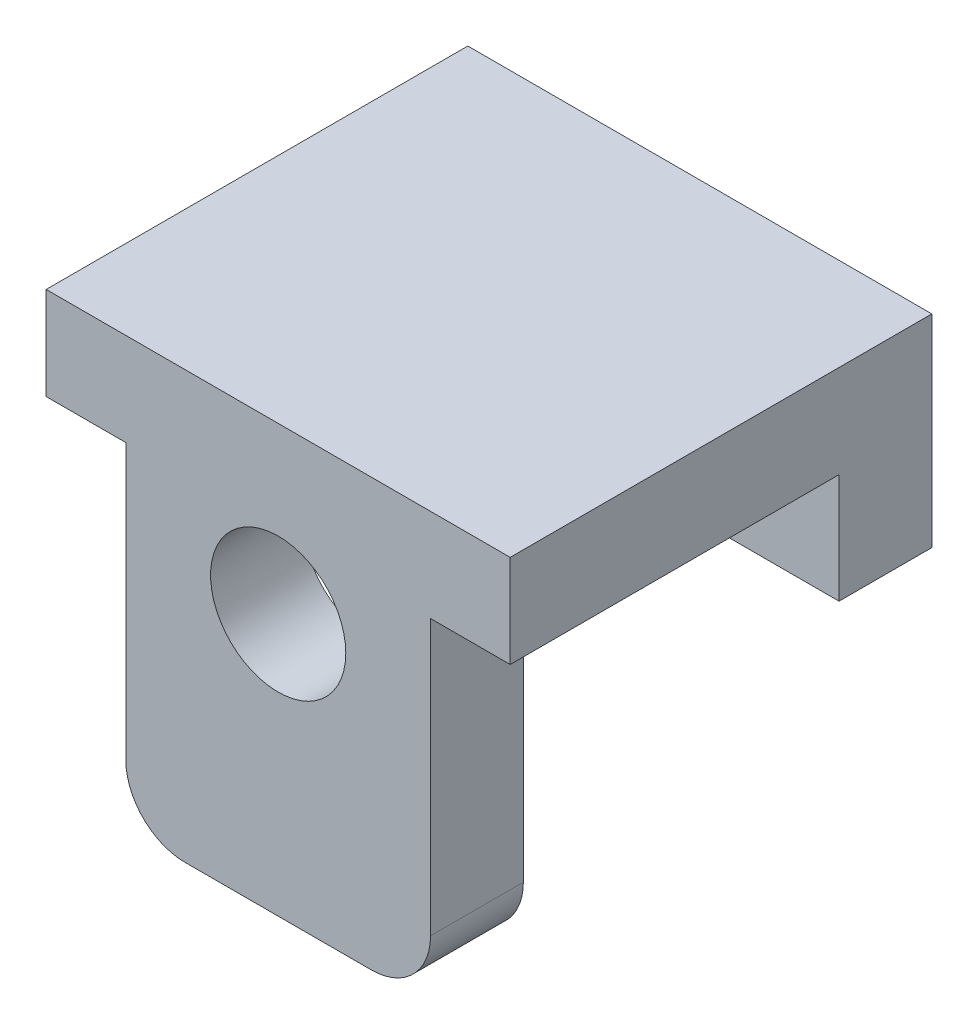
ISO-10303-21;
HEADER;
FILE_DESCRIPTION(('STEP AP214'),'2;1');
FILE_NAME('part.step','',(''),(''),'','','');
FILE_SCHEMA(('AUTOMOTIVE_DESIGN { 1 0 10303 214 1 1 1 1 }'));
ENDSEC;
DATA;
#1=APPLICATION_CONTEXT('core data for automotive mechanical design processes');
#2=APPLICATION_PROTOCOL_DEFINITION('international standard','automotive_design',2000,#1);
#3=PRODUCT_CONTEXT('',#1,'mechanical');
#4=PRODUCT('Part','Part','',(#3));
#5=PRODUCT_RELATED_PRODUCT_CATEGORY('part','',(#4));
#6=PRODUCT_DEFINITION_FORMATION('','',#4);
#7=PRODUCT_DEFINITION_CONTEXT('part definition',#1,'design');
#8=PRODUCT_DEFINITION('design','',#6,#7);
#9=PRODUCT_DEFINITION_SHAPE('','',#8);
#10=(LENGTH_UNIT() NAMED_UNIT(*) SI_UNIT(.MILLI.,.METRE.));
#11=(NAMED_UNIT(*) PLANE_ANGLE_UNIT() SI_UNIT($,.RADIAN.));
#12=(NAMED_UNIT(*) SI_UNIT($,.STERADIAN.) SOLID_ANGLE_UNIT());
#13=UNCERTAINTY_MEASURE_WITH_UNIT(LENGTH_MEASURE(1.E-05),#10,'distance_accuracy_value','');
#14=(GEOMETRIC_REPRESENTATION_CONTEXT(3) GLOBAL_UNCERTAINTY_ASSIGNED_CONTEXT((#13)) GLOBAL_UNIT_ASSIGNED_CONTEXT((#10,
#11,#12)) REPRESENTATION_CONTEXT('',''));
#15=CARTESIAN_POINT('',(0.,0.,0.));
#16=DIRECTION('',(0.,0.,1.));
#17=DIRECTION('',(1.,0.,0.));
#18=AXIS2_PLACEMENT_3D('',#15,#16,#17);
#19=CARTESIAN_POINT('',(-3.17499999999999,1.38500000000001,1.27));
#20=DIRECTION('',(1.,0.,0.));
#21=DIRECTION('',(0.,1.,0.));
#22=AXIS2_PLACEMENT_3D('',#19,#20,#21);
#23=PLANE('',#22);
#24=DIRECTION('',(0.,-1.,0.));
#25=VECTOR('',#24,1.);
#26=CARTESIAN_POINT('',(-3.17499999999999,1.38500000000001,0.));
#27=LINE('',#26,#25);
#28=CARTESIAN_POINT('',(-3.17499999999999,1.38500000000001,0.));
#29=VERTEX_POINT('',#28);
#30=CARTESIAN_POINT('',(-3.17499999999999,-1.385,0.));
#31=VERTEX_POINT('',#30);
#32=EDGE_CURVE('E177',#29,#31,#27,.T.);
#33=ORIENTED_EDGE('',*,*,#32,.T.);
#34=DIRECTION('',(0.,0.,-1.));
#35=VECTOR('',#34,1.);
#36=CARTESIAN_POINT('',(-3.17499999999999,-1.385,1.27));
#37=LINE('',#36,#35);
#38=CARTESIAN_POINT('',(-3.17499999999999,-1.385,1.27));
#39=VERTEX_POINT('',#38);
#40=EDGE_CURVE('E183',#39,#31,#37,.T.);
#41=ORIENTED_EDGE('',*,*,#40,.F.);
#42=DIRECTION('',(0.,-1.,0.));
#43=VECTOR('',#42,1.);
#44=CARTESIAN_POINT('',(-3.17499999999999,1.38500000000001,1.27));
#45=LINE('',#44,#43);
#46=CARTESIAN_POINT('',(-3.17499999999999,0.115000000000008,1.27));
#47=VERTEX_POINT('',#46);
#48=EDGE_CURVE('E261',#47,#39,#45,.T.);
#49=ORIENTED_EDGE('',*,*,#48,.F.);
#50=DIRECTION('',(0.,0.,-1.));
#51=VECTOR('',#50,1.);
#52=CARTESIAN_POINT('',(-3.17499999999999,0.115000000000008,5.77));
#53=LINE('',#52,#51);
#54=CARTESIAN_POINT('',(-3.17499999999999,0.115000000000008,5.77));
#55=VERTEX_POINT('',#54);
#56=EDGE_CURVE('E172',#55,#47,#53,.T.);
#57=ORIENTED_EDGE('',*,*,#56,.F.);
#58=DIRECTION('',(0.,-1.,0.));
#59=VECTOR('',#58,1.);
#60=CARTESIAN_POINT('',(-3.17499999999999,1.38500000000001,5.77));
#61=LINE('',#60,#59);
#62=CARTESIAN_POINT('',(-3.17499999999999,1.38500000000001,5.77));
#63=VERTEX_POINT('',#62);
#64=EDGE_CURVE('E146',#63,#55,#61,.T.);
#65=ORIENTED_EDGE('',*,*,#64,.F.);
#66=DIRECTION('',(0.,0.,-1.));
#67=VECTOR('',#66,1.);
#68=CARTESIAN_POINT('',(-3.17499999999999,1.38500000000001,1.27));
#69=LINE('',#68,#67);
#70=EDGE_CURVE('E277',#63,#29,#69,.T.);
#71=ORIENTED_EDGE('',*,*,#70,.T.);
#72=EDGE_LOOP('',(#33,#41,#49,#57,#65,#71));
#73=FACE_BOUND('',#72,.T.);
#74=ADVANCED_FACE('F31',(#73),#23,.F.);
#75=CARTESIAN_POINT('',(-3.17499999999999,-1.385,1.27));
#76=DIRECTION('',(0.,1.,0.));
#77=DIRECTION('',(0.,0.,1.));
#78=AXIS2_PLACEMENT_3D('',#75,#76,#77);
#79=PLANE('',#78);
#80=DIRECTION('',(1.,0.,0.));
#81=VECTOR('',#80,1.);
#82=CARTESIAN_POINT('',(-3.17499999999999,-1.385,0.));
#83=LINE('',#82,#81);
#84=CARTESIAN_POINT('',(3.17500000000001,-1.385,0.));
#85=VERTEX_POINT('',#84);
#86=EDGE_CURVE('E280',#31,#85,#83,.T.);
#87=ORIENTED_EDGE('',*,*,#86,.T.);
#88=DIRECTION('',(0.,0.,-1.));
#89=VECTOR('',#88,1.);
#90=CARTESIAN_POINT('',(3.17500000000001,-1.385,1.27));
#91=LINE('',#90,#89);
#92=CARTESIAN_POINT('',(3.17500000000001,-1.385,1.27));
#93=VERTEX_POINT('',#92);
#94=EDGE_CURVE('E271',#93,#85,#91,.T.);
#95=ORIENTED_EDGE('',*,*,#94,.F.);
#96=DIRECTION('',(1.,0.,0.));
#97=VECTOR('',#96,1.);
#98=CARTESIAN_POINT('',(-3.17499999999999,-1.385,1.27));
#99=LINE('',#98,#97);
#100=EDGE_CURVE('E265',#39,#93,#99,.T.);
#101=ORIENTED_EDGE('',*,*,#100,.F.);
#102=ORIENTED_EDGE('',*,*,#40,.T.);
#103=EDGE_LOOP('',(#87,#95,#101,#102));
#104=FACE_BOUND('',#103,.T.);
#105=ADVANCED_FACE('F237',(#104),#79,.F.);
#106=CARTESIAN_POINT('',(3.17500000000001,1.38500000000001,1.27));
#107=DIRECTION('',(-1.,0.,0.));
#108=DIRECTION('',(0.,0.,1.));
#109=AXIS2_PLACEMENT_3D('',#106,#107,#108);
#110=PLANE('',#109);
#111=DIRECTION('',(0.,1.,0.));
#112=VECTOR('',#111,1.);
#113=CARTESIAN_POINT('',(3.17500000000001,1.38500000000001,0.));
#114=LINE('',#113,#112);
#115=CARTESIAN_POINT('',(3.17500000000001,1.38500000000001,0.));
#116=VERTEX_POINT('',#115);
#117=EDGE_CURVE('E267',#85,#116,#114,.T.);
#118=ORIENTED_EDGE('',*,*,#117,.T.);
#119=DIRECTION('',(0.,0.,-1.));
#120=VECTOR('',#119,1.);
#121=CARTESIAN_POINT('',(3.17500000000001,1.38500000000001,1.27));
#122=LINE('',#121,#120);
#123=CARTESIAN_POINT('',(3.17500000000001,1.38500000000001,5.77));
#124=VERTEX_POINT('',#123);
#125=EDGE_CURVE('E274',#124,#116,#122,.T.);
#126=ORIENTED_EDGE('',*,*,#125,.F.);
#127=DIRECTION('',(0.,1.,0.));
#128=VECTOR('',#127,1.);
#129=CARTESIAN_POINT('',(3.17500000000001,1.38500000000001,5.77));
#130=LINE('',#129,#128);
#131=CARTESIAN_POINT('',(3.17500000000001,0.115000000000008,5.77));
#132=VERTEX_POINT('',#131);
#133=EDGE_CURVE('E152',#132,#124,#130,.T.);
#134=ORIENTED_EDGE('',*,*,#133,.F.);
#135=DIRECTION('',(0.,0.,-1.));
#136=VECTOR('',#135,1.);
#137=CARTESIAN_POINT('',(3.17500000000001,0.115000000000008,5.77));
#138=LINE('',#137,#136);
#139=CARTESIAN_POINT('',(3.17500000000001,0.115000000000008,1.27));
#140=VERTEX_POINT('',#139);
#141=EDGE_CURVE('E158',#132,#140,#138,.T.);
#142=ORIENTED_EDGE('',*,*,#141,.T.);
#143=DIRECTION('',(0.,1.,0.));
#144=VECTOR('',#143,1.);
#145=CARTESIAN_POINT('',(3.17500000000001,1.38500000000001,1.27));
#146=LINE('',#145,#144);
#147=EDGE_CURVE('E167',#93,#140,#146,.T.);
#148=ORIENTED_EDGE('',*,*,#147,.F.);
#149=ORIENTED_EDGE('',*,*,#94,.T.);
#150=EDGE_LOOP('',(#118,#126,#134,#142,#148,#149));
#151=FACE_BOUND('',#150,.T.);
#152=ADVANCED_FACE('F243',(#151),#110,.F.);
#153=CARTESIAN_POINT('',(-3.17499999999999,1.38500000000001,1.27));
#154=DIRECTION('',(0.,-1.,0.));
#155=DIRECTION('',(0.,0.,-1.));
#156=AXIS2_PLACEMENT_3D('',#153,#154,#155);
#157=PLANE('',#156);
#158=DIRECTION('',(-1.,0.,0.));
#159=VECTOR('',#158,1.);
#160=CARTESIAN_POINT('',(-3.17499999999999,1.38500000000001,0.));
#161=LINE('',#160,#159);
#162=EDGE_CURVE('E266',#116,#29,#161,.T.);
#163=ORIENTED_EDGE('',*,*,#162,.T.);
#164=ORIENTED_EDGE('',*,*,#70,.F.);
#165=DIRECTION('',(-1.,0.,0.));
#166=VECTOR('',#165,1.);
#167=CARTESIAN_POINT('',(-3.17499999999999,1.38500000000001,5.77));
#168=LINE('',#167,#166);
#169=EDGE_CURVE('E155',#124,#63,#168,.T.);
#170=ORIENTED_EDGE('',*,*,#169,.F.);
#171=ORIENTED_EDGE('',*,*,#125,.T.);
#172=EDGE_LOOP('',(#163,#164,#170,#171));
#173=FACE_BOUND('',#172,.T.);
#174=ADVANCED_FACE('F294',(#173),#157,.F.);
#175=CARTESIAN_POINT('',(-3.17499999999999,-1.385,1.27));
#176=DIRECTION('',(0.,0.,1.));
#177=DIRECTION('',(1.,0.,0.));
#178=AXIS2_PLACEMENT_3D('',#175,#176,#177);
#179=PLANE('',#178);
#180=DIRECTION('',(1.,0.,0.));
#181=VECTOR('',#180,1.);
#182=CARTESIAN_POINT('',(-3.17499999999999,0.115000000000008,1.27));
#183=LINE('',#182,#181);
#184=EDGE_CURVE('E142',#47,#140,#183,.T.);
#185=ORIENTED_EDGE('',*,*,#184,.F.);
#186=ORIENTED_EDGE('',*,*,#48,.T.);
#187=ORIENTED_EDGE('',*,*,#100,.T.);
#188=ORIENTED_EDGE('',*,*,#147,.T.);
#189=EDGE_LOOP('',(#185,#186,#187,#188));
#190=FACE_BOUND('',#189,.T.);
#191=ADVANCED_FACE('F289',(#190),#179,.T.);
#192=CARTESIAN_POINT('',(-3.17499999999999,-1.385,0.));
#193=DIRECTION('',(0.,0.,1.));
#194=DIRECTION('',(1.,0.,0.));
#195=AXIS2_PLACEMENT_3D('',#192,#193,#194);
#196=PLANE('',#195);
#197=ORIENTED_EDGE('',*,*,#32,.F.);
#198=ORIENTED_EDGE('',*,*,#162,.F.);
#199=ORIENTED_EDGE('',*,*,#117,.F.);
#200=ORIENTED_EDGE('',*,*,#86,.F.);
#201=EDGE_LOOP('',(#197,#198,#199,#200));
#202=FACE_BOUND('',#201,.T.);
#203=ADVANCED_FACE('F234',(#202),#196,.F.);
#204=CARTESIAN_POINT('',(-3.17499999999999,0.115000000000008,5.77));
#205=DIRECTION('',(0.,1.,0.));
#206=DIRECTION('',(0.,0.,1.));
#207=AXIS2_PLACEMENT_3D('',#204,#205,#206);
#208=PLANE('',#207);
#209=DIRECTION('',(-1.,0.,0.));
#210=VECTOR('',#209,1.);
#211=CARTESIAN_POINT('',(-2.085,0.115000000000008,4.5));
#212=LINE('',#211,#210);
#213=CARTESIAN_POINT('',(2.085,0.115000000000008,4.5));
#214=VERTEX_POINT('',#213);
#215=CARTESIAN_POINT('',(-2.085,0.115000000000008,4.5));
#216=VERTEX_POINT('',#215);
#217=EDGE_CURVE('E128',#214,#216,#212,.T.);
#218=ORIENTED_EDGE('',*,*,#217,.T.);
#219=DIRECTION('',(0.,0.,1.));
#220=VECTOR('',#219,1.);
#221=CARTESIAN_POINT('',(-2.085,0.115000000000008,4.5));
#222=LINE('',#221,#220);
#223=CARTESIAN_POINT('',(-2.085,0.115000000000008,5.77));
#224=VERTEX_POINT('',#223);
#225=EDGE_CURVE('E140',#216,#224,#222,.T.);
#226=ORIENTED_EDGE('',*,*,#225,.T.);
#227=DIRECTION('',(1.,0.,0.));
#228=VECTOR('',#227,1.);
#229=CARTESIAN_POINT('',(-3.17499999999999,0.115000000000008,5.77));
#230=LINE('',#229,#228);
#231=EDGE_CURVE('E149',#55,#224,#230,.T.);
#232=ORIENTED_EDGE('',*,*,#231,.F.);
#233=ORIENTED_EDGE('',*,*,#56,.T.);
#234=ORIENTED_EDGE('',*,*,#184,.T.);
#235=ORIENTED_EDGE('',*,*,#141,.F.);
#236=CARTESIAN_POINT('',(2.085,0.115000000000008,5.77));
#237=VERTEX_POINT('',#236);
#238=EDGE_CURVE('E139',#237,#132,#230,.T.);
#239=ORIENTED_EDGE('',*,*,#238,.F.);
#240=DIRECTION('',(0.,0.,1.));
#241=VECTOR('',#240,1.);
#242=CARTESIAN_POINT('',(2.085,0.115000000000008,4.5));
#243=LINE('',#242,#241);
#244=EDGE_CURVE('E125',#214,#237,#243,.T.);
#245=ORIENTED_EDGE('',*,*,#244,.F.);
#246=EDGE_LOOP('',(#218,#226,#232,#233,#234,#235,#239,#245));
#247=FACE_BOUND('',#246,.T.);
#248=ADVANCED_FACE('F137',(#247),#208,.F.);
#249=CARTESIAN_POINT('',(-3.17499999999999,0.115000000000008,5.77));
#250=DIRECTION('',(0.,0.,1.));
#251=DIRECTION('',(1.,0.,0.));
#252=AXIS2_PLACEMENT_3D('',#249,#250,#251);
#253=PLANE('',#252);
#254=DIRECTION('',(1.,0.,0.));
#255=VECTOR('',#254,1.);
#256=CARTESIAN_POINT('',(-2.085,-4.45499999999999,5.77));
#257=LINE('',#256,#255);
#258=CARTESIAN_POINT('',(-1.275,-4.45499999999999,5.77));
#259=VERTEX_POINT('',#258);
#260=CARTESIAN_POINT('',(1.275,-4.45499999999999,5.77));
#261=VERTEX_POINT('',#260);
#262=EDGE_CURVE('E205',#259,#261,#257,.T.);
#263=ORIENTED_EDGE('',*,*,#262,.T.);
#264=CARTESIAN_POINT('',(1.275,-3.64499999999999,5.77));
#265=DIRECTION('',(0.,0.,1.));
#266=DIRECTION('',(1.,0.,0.));
#267=AXIS2_PLACEMENT_3D('',#264,#265,#266);
#268=CIRCLE('',#267,0.81);
#269=CARTESIAN_POINT('',(2.085,-3.64499999999999,5.77));
#270=VERTEX_POINT('',#269);
#271=EDGE_CURVE('E188',#261,#270,#268,.T.);
#272=ORIENTED_EDGE('',*,*,#271,.T.);
#273=DIRECTION('',(0.,1.,0.));
#274=VECTOR('',#273,1.);
#275=CARTESIAN_POINT('',(2.085,0.115000000000008,5.77));
#276=LINE('',#275,#274);
#277=EDGE_CURVE('E204',#270,#237,#276,.T.);
#278=ORIENTED_EDGE('',*,*,#277,.T.);
#279=ORIENTED_EDGE('',*,*,#238,.T.);
#280=ORIENTED_EDGE('',*,*,#133,.T.);
#281=ORIENTED_EDGE('',*,*,#169,.T.);
#282=ORIENTED_EDGE('',*,*,#64,.T.);
#283=ORIENTED_EDGE('',*,*,#231,.T.);
#284=DIRECTION('',(0.,-1.,0.));
#285=VECTOR('',#284,1.);
#286=CARTESIAN_POINT('',(-2.085,0.115000000000008,5.77));
#287=LINE('',#286,#285);
#288=CARTESIAN_POINT('',(-2.085,-3.64499999999999,5.77));
#289=VERTEX_POINT('',#288);
#290=EDGE_CURVE('E207',#224,#289,#287,.T.);
#291=ORIENTED_EDGE('',*,*,#290,.T.);
#292=CARTESIAN_POINT('',(-1.275,-3.64499999999999,5.77));
#293=DIRECTION('',(0.,0.,1.));
#294=DIRECTION('',(1.,0.,0.));
#295=AXIS2_PLACEMENT_3D('',#292,#293,#294);
#296=CIRCLE('',#295,0.81);
#297=EDGE_CURVE('E186',#289,#259,#296,.T.);
#298=ORIENTED_EDGE('',*,*,#297,.T.);
#299=EDGE_LOOP('',(#263,#272,#278,#279,#280,#281,#282,#283,#291,#298));
#300=FACE_BOUND('',#299,.T.);
#301=CARTESIAN_POINT('',(0.,-0.874999999999992,5.77));
#302=DIRECTION('',(0.,0.,1.));
#303=DIRECTION('',(1.,0.,0.));
#304=AXIS2_PLACEMENT_3D('',#301,#302,#303);
#305=CIRCLE('',#304,0.925);
#306=CARTESIAN_POINT('',(0.925,-0.874999999999992,5.77));
#307=VERTEX_POINT('',#306);
#308=EDGE_CURVE('E213',#307,#307,#305,.T.);
#309=ORIENTED_EDGE('',*,*,#308,.F.);
#310=EDGE_LOOP('',(#309));
#311=FACE_BOUND('',#310,.T.);
#312=ADVANCED_FACE('F202',(#300,#311),#253,.T.);
#313=CARTESIAN_POINT('',(-2.085,0.115000000000008,4.5));
#314=DIRECTION('',(-1.,0.,0.));
#315=DIRECTION('',(0.,-1.,0.));
#316=AXIS2_PLACEMENT_3D('',#313,#314,#315);
#317=PLANE('',#316);
#318=DIRECTION('',(0.,-1.,0.));
#319=VECTOR('',#318,1.);
#320=CARTESIAN_POINT('',(-2.085,0.115000000000008,4.5));
#321=LINE('',#320,#319);
#322=CARTESIAN_POINT('',(-2.085,-3.64499999999999,4.5));
#323=VERTEX_POINT('',#322);
#324=EDGE_CURVE('E133',#216,#323,#321,.T.);
#325=ORIENTED_EDGE('',*,*,#324,.T.);
#326=DIRECTION('',(0.,0.,1.));
#327=VECTOR('',#326,1.);
#328=CARTESIAN_POINT('',(-2.085,-3.64499999999999,4.5));
#329=LINE('',#328,#327);
#330=EDGE_CURVE('E11',#323,#289,#329,.T.);
#331=ORIENTED_EDGE('',*,*,#330,.T.);
#332=ORIENTED_EDGE('',*,*,#290,.F.);
#333=ORIENTED_EDGE('',*,*,#225,.F.);
#334=EDGE_LOOP('',(#325,#331,#332,#333));
#335=FACE_BOUND('',#334,.T.);
#336=ADVANCED_FACE('F226',(#335),#317,.T.);
#337=CARTESIAN_POINT('',(2.085,0.115000000000008,4.5));
#338=DIRECTION('',(1.,0.,0.));
#339=DIRECTION('',(0.,1.,0.));
#340=AXIS2_PLACEMENT_3D('',#337,#338,#339);
#341=PLANE('',#340);
#342=ORIENTED_EDGE('',*,*,#277,.F.);
#343=DIRECTION('',(0.,0.,1.));
#344=VECTOR('',#343,1.);
#345=CARTESIAN_POINT('',(2.085,-3.64499999999999,4.5));
#346=LINE('',#345,#344);
#347=CARTESIAN_POINT('',(2.085,-3.64499999999999,4.5));
#348=VERTEX_POINT('',#347);
#349=EDGE_CURVE('E54',#270,#348,#346,.F.);
#350=ORIENTED_EDGE('',*,*,#349,.T.);
#351=DIRECTION('',(0.,1.,0.));
#352=VECTOR('',#351,1.);
#353=CARTESIAN_POINT('',(2.085,0.115000000000008,4.5));
#354=LINE('',#353,#352);
#355=EDGE_CURVE('E121',#348,#214,#354,.T.);
#356=ORIENTED_EDGE('',*,*,#355,.T.);
#357=ORIENTED_EDGE('',*,*,#244,.T.);
#358=EDGE_LOOP('',(#342,#350,#356,#357));
#359=FACE_BOUND('',#358,.T.);
#360=ADVANCED_FACE('F123',(#359),#341,.T.);
#361=CARTESIAN_POINT('',(-2.085,-4.45499999999999,4.5));
#362=DIRECTION('',(0.,-1.,0.));
#363=DIRECTION('',(1.,0.,0.));
#364=AXIS2_PLACEMENT_3D('',#361,#362,#363);
#365=PLANE('',#364);
#366=DIRECTION('',(1.,0.,0.));
#367=VECTOR('',#366,1.);
#368=CARTESIAN_POINT('',(-2.085,-4.45499999999999,4.5));
#369=LINE('',#368,#367);
#370=CARTESIAN_POINT('',(-1.275,-4.45499999999999,4.5));
#371=VERTEX_POINT('',#370);
#372=CARTESIAN_POINT('',(1.275,-4.45499999999999,4.5));
#373=VERTEX_POINT('',#372);
#374=EDGE_CURVE('E129',#371,#373,#369,.T.);
#375=ORIENTED_EDGE('',*,*,#374,.T.);
#376=DIRECTION('',(0.,0.,1.));
#377=VECTOR('',#376,1.);
#378=CARTESIAN_POINT('',(1.275,-4.45499999999999,4.5));
#379=LINE('',#378,#377);
#380=EDGE_CURVE('E182',#373,#261,#379,.T.);
#381=ORIENTED_EDGE('',*,*,#380,.T.);
#382=ORIENTED_EDGE('',*,*,#262,.F.);
#383=DIRECTION('',(0.,0.,1.));
#384=VECTOR('',#383,1.);
#385=CARTESIAN_POINT('',(-1.275,-4.45499999999999,4.5));
#386=LINE('',#385,#384);
#387=EDGE_CURVE('E180',#259,#371,#386,.F.);
#388=ORIENTED_EDGE('',*,*,#387,.T.);
#389=EDGE_LOOP('',(#375,#381,#382,#388));
#390=FACE_BOUND('',#389,.T.);
#391=ADVANCED_FACE('F195',(#390),#365,.T.);
#392=CARTESIAN_POINT('',(-2.085,0.115000000000008,4.5));
#393=DIRECTION('',(0.,0.,1.));
#394=DIRECTION('',(1.,0.,0.));
#395=AXIS2_PLACEMENT_3D('',#392,#393,#394);
#396=PLANE('',#395);
#397=CARTESIAN_POINT('',(0.,-0.874999999999992,4.5));
#398=DIRECTION('',(0.,0.,1.));
#399=DIRECTION('',(1.,0.,0.));
#400=AXIS2_PLACEMENT_3D('',#397,#398,#399);
#401=CIRCLE('',#400,0.925);
#402=CARTESIAN_POINT('',(0.925,-0.874999999999992,4.5));
#403=VERTEX_POINT('',#402);
#404=EDGE_CURVE('E211',#403,#403,#401,.T.);
#405=ORIENTED_EDGE('',*,*,#404,.T.);
#406=EDGE_LOOP('',(#405));
#407=FACE_BOUND('',#406,.T.);
#408=ORIENTED_EDGE('',*,*,#355,.F.);
#409=CARTESIAN_POINT('',(1.275,-3.64499999999999,4.5));
#410=DIRECTION('',(0.,0.,1.));
#411=DIRECTION('',(1.,0.,0.));
#412=AXIS2_PLACEMENT_3D('',#409,#410,#411);
#413=CIRCLE('',#412,0.81);
#414=EDGE_CURVE('E39',#348,#373,#413,.F.);
#415=ORIENTED_EDGE('',*,*,#414,.T.);
#416=ORIENTED_EDGE('',*,*,#374,.F.);
#417=CARTESIAN_POINT('',(-1.275,-3.64499999999999,4.5));
#418=DIRECTION('',(0.,0.,1.));
#419=DIRECTION('',(1.,0.,0.));
#420=AXIS2_PLACEMENT_3D('',#417,#418,#419);
#421=CIRCLE('',#420,0.81);
#422=EDGE_CURVE('E46',#371,#323,#421,.F.);
#423=ORIENTED_EDGE('',*,*,#422,.T.);
#424=ORIENTED_EDGE('',*,*,#324,.F.);
#425=ORIENTED_EDGE('',*,*,#217,.F.);
#426=EDGE_LOOP('',(#408,#415,#416,#423,#424,#425));
#427=FACE_BOUND('',#426,.T.);
#428=ADVANCED_FACE('F132',(#407,#427),#396,.F.);
#429=CARTESIAN_POINT('',(0.,-0.874999999999992,4.5));
#430=DIRECTION('',(0.,0.,1.));
#431=DIRECTION('',(1.,0.,0.));
#432=AXIS2_PLACEMENT_3D('',#429,#430,#431);
#433=CYLINDRICAL_SURFACE('',#432,0.925);
#434=ORIENTED_EDGE('',*,*,#404,.F.);
#435=EDGE_LOOP('',(#434));
#436=FACE_BOUND('',#435,.T.);
#437=ORIENTED_EDGE('',*,*,#308,.T.);
#438=EDGE_LOOP('',(#437));
#439=FACE_BOUND('',#438,.T.);
#440=ADVANCED_FACE('F220',(#436,#439),#433,.F.);
#441=CARTESIAN_POINT('',(1.275,-3.64499999999999,4.5));
#442=DIRECTION('',(0.,0.,1.));
#443=DIRECTION('',(1.,0.,0.));
#444=AXIS2_PLACEMENT_3D('',#441,#442,#443);
#445=CYLINDRICAL_SURFACE('',#444,0.81);
#446=ORIENTED_EDGE('',*,*,#414,.F.);
#447=ORIENTED_EDGE('',*,*,#349,.F.);
#448=ORIENTED_EDGE('',*,*,#271,.F.);
#449=ORIENTED_EDGE('',*,*,#380,.F.);
#450=EDGE_LOOP('',(#446,#447,#448,#449));
#451=FACE_BOUND('',#450,.T.);
#452=ADVANCED_FACE('F200',(#451),#445,.T.);
#453=CARTESIAN_POINT('',(-1.275,-3.64499999999999,4.5));
#454=DIRECTION('',(0.,0.,1.));
#455=DIRECTION('',(1.,0.,0.));
#456=AXIS2_PLACEMENT_3D('',#453,#454,#455);
#457=CYLINDRICAL_SURFACE('',#456,0.81);
#458=ORIENTED_EDGE('',*,*,#422,.F.);
#459=ORIENTED_EDGE('',*,*,#387,.F.);
#460=ORIENTED_EDGE('',*,*,#297,.F.);
#461=ORIENTED_EDGE('',*,*,#330,.F.);
#462=EDGE_LOOP('',(#458,#459,#460,#461));
#463=FACE_BOUND('',#462,.T.);
#464=ADVANCED_FACE('F33',(#463),#457,.T.);
#465=CLOSED_SHELL('',(#74,#105,#152,#174,#191,#203,#248,#312,#336,#360,#391,#428,#440,#452,#464));
#466=MANIFOLD_SOLID_BREP('B2',#465);
#467=ADVANCED_BREP_SHAPE_REPRESENTATION('',(#18,#466),#14);
#468=SHAPE_DEFINITION_REPRESENTATION(#9,#467);
ENDSEC;
END-ISO-10303-21;
